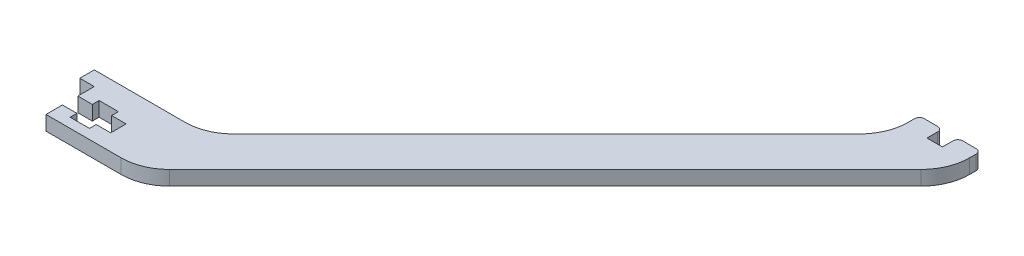
ISO-10303-21;
HEADER;
FILE_DESCRIPTION(('STEP AP214'),'2;1');
FILE_NAME('part.step','',(''),(''),'','','');
FILE_SCHEMA(('AUTOMOTIVE_DESIGN { 1 0 10303 214 1 1 1 1 }'));
ENDSEC;
DATA;
#1=APPLICATION_CONTEXT('core data for automotive mechanical design processes');
#2=APPLICATION_PROTOCOL_DEFINITION('international standard','automotive_design',2000,#1);
#3=PRODUCT_CONTEXT('',#1,'mechanical');
#4=PRODUCT('Part','Part','',(#3));
#5=PRODUCT_RELATED_PRODUCT_CATEGORY('part','',(#4));
#6=PRODUCT_DEFINITION_FORMATION('','',#4);
#7=PRODUCT_DEFINITION_CONTEXT('part definition',#1,'design');
#8=PRODUCT_DEFINITION('design','',#6,#7);
#9=PRODUCT_DEFINITION_SHAPE('','',#8);
#10=(LENGTH_UNIT() NAMED_UNIT(*) SI_UNIT(.MILLI.,.METRE.));
#11=(NAMED_UNIT(*) PLANE_ANGLE_UNIT() SI_UNIT($,.RADIAN.));
#12=(NAMED_UNIT(*) SI_UNIT($,.STERADIAN.) SOLID_ANGLE_UNIT());
#13=UNCERTAINTY_MEASURE_WITH_UNIT(LENGTH_MEASURE(1.E-05),#10,'distance_accuracy_value','');
#14=(GEOMETRIC_REPRESENTATION_CONTEXT(3) GLOBAL_UNCERTAINTY_ASSIGNED_CONTEXT((#13)) GLOBAL_UNIT_ASSIGNED_CONTEXT((#10,
#11,#12)) REPRESENTATION_CONTEXT('',''));
#15=CARTESIAN_POINT('',(0.,0.,0.));
#16=DIRECTION('',(0.,0.,1.));
#17=DIRECTION('',(1.,0.,0.));
#18=AXIS2_PLACEMENT_3D('',#15,#16,#17);
#19=CARTESIAN_POINT('',(15.857864376269,3.,-23.));
#20=DIRECTION('',(0.,-1.,0.));
#21=DIRECTION('',(0.,0.,-1.));
#22=AXIS2_PLACEMENT_3D('',#19,#20,#21);
#23=CYLINDRICAL_SURFACE('',#22,10.);
#24=CARTESIAN_POINT('',(15.857864376269,0.,-23.));
#25=DIRECTION('',(0.,1.,0.));
#26=DIRECTION('',(0.,0.,1.));
#27=AXIS2_PLACEMENT_3D('',#24,#25,#26);
#28=CIRCLE('',#27,10.);
#29=CARTESIAN_POINT('',(15.857864376269,0.,-13.));
#30=VERTEX_POINT('',#29);
#31=CARTESIAN_POINT('',(22.9289321881346,0.,-15.9289321881346));
#32=VERTEX_POINT('',#31);
#33=EDGE_CURVE('E306',#30,#32,#28,.T.);
#34=ORIENTED_EDGE('',*,*,#33,.F.);
#35=DIRECTION('',(0.,-1.,0.));
#36=VECTOR('',#35,1.);
#37=CARTESIAN_POINT('',(15.857864376269,3.,-13.));
#38=LINE('',#37,#36);
#39=CARTESIAN_POINT('',(15.857864376269,3.,-13.));
#40=VERTEX_POINT('',#39);
#41=EDGE_CURVE('E301',#40,#30,#38,.T.);
#42=ORIENTED_EDGE('',*,*,#41,.F.);
#43=CARTESIAN_POINT('',(15.857864376269,3.,-23.));
#44=DIRECTION('',(0.,1.,0.));
#45=DIRECTION('',(0.,0.,1.));
#46=AXIS2_PLACEMENT_3D('',#43,#44,#45);
#47=CIRCLE('',#46,10.);
#48=CARTESIAN_POINT('',(22.9289321881346,3.,-15.9289321881346));
#49=VERTEX_POINT('',#48);
#50=EDGE_CURVE('E303',#40,#49,#47,.T.);
#51=ORIENTED_EDGE('',*,*,#50,.T.);
#52=DIRECTION('',(0.,-1.,0.));
#53=VECTOR('',#52,1.);
#54=CARTESIAN_POINT('',(22.9289321881346,3.,-15.9289321881346));
#55=LINE('',#54,#53);
#56=EDGE_CURVE('E416',#49,#32,#55,.T.);
#57=ORIENTED_EDGE('',*,*,#56,.T.);
#58=EDGE_LOOP('',(#34,#42,#51,#57));
#59=FACE_BOUND('',#58,.T.);
#60=ADVANCED_FACE('F39',(#59),#23,.F.);
#61=CARTESIAN_POINT('',(0.,3.,-13.));
#62=DIRECTION('',(0.,0.,-1.));
#63=DIRECTION('',(-1.,0.,0.));
#64=AXIS2_PLACEMENT_3D('',#61,#62,#63);
#65=PLANE('',#64);
#66=DIRECTION('',(1.,0.,0.));
#67=VECTOR('',#66,1.);
#68=CARTESIAN_POINT('',(0.,0.,-13.));
#69=LINE('',#68,#67);
#70=CARTESIAN_POINT('',(-3.,0.,-13.));
#71=VERTEX_POINT('',#70);
#72=EDGE_CURVE('E419',#71,#30,#69,.T.);
#73=ORIENTED_EDGE('',*,*,#72,.F.);
#74=DIRECTION('',(0.,-1.,0.));
#75=VECTOR('',#74,1.);
#76=CARTESIAN_POINT('',(-3.,3.,-13.));
#77=LINE('',#76,#75);
#78=CARTESIAN_POINT('',(-3.,3.,-13.));
#79=VERTEX_POINT('',#78);
#80=EDGE_CURVE('E313',#79,#71,#77,.T.);
#81=ORIENTED_EDGE('',*,*,#80,.F.);
#82=DIRECTION('',(1.,0.,0.));
#83=VECTOR('',#82,1.);
#84=CARTESIAN_POINT('',(0.,3.,-13.));
#85=LINE('',#84,#83);
#86=EDGE_CURVE('E318',#79,#40,#85,.T.);
#87=ORIENTED_EDGE('',*,*,#86,.T.);
#88=ORIENTED_EDGE('',*,*,#41,.T.);
#89=EDGE_LOOP('',(#73,#81,#87,#88));
#90=FACE_BOUND('',#89,.T.);
#91=ADVANCED_FACE('F325',(#90),#65,.T.);
#92=CARTESIAN_POINT('',(-3.,3.,0.));
#93=DIRECTION('',(1.,0.,0.));
#94=DIRECTION('',(0.,0.,-1.));
#95=AXIS2_PLACEMENT_3D('',#92,#93,#94);
#96=PLANE('',#95);
#97=DIRECTION('',(0.,0.,1.));
#98=VECTOR('',#97,1.);
#99=CARTESIAN_POINT('',(-3.,0.,0.));
#100=LINE('',#99,#98);
#101=CARTESIAN_POINT('',(-3.,0.,-10.));
#102=VERTEX_POINT('',#101);
#103=EDGE_CURVE('E422',#71,#102,#100,.T.);
#104=ORIENTED_EDGE('',*,*,#103,.T.);
#105=DIRECTION('',(0.,-1.,0.));
#106=VECTOR('',#105,1.);
#107=CARTESIAN_POINT('',(-3.,3.,-10.));
#108=LINE('',#107,#106);
#109=CARTESIAN_POINT('',(-3.,3.,-10.));
#110=VERTEX_POINT('',#109);
#111=EDGE_CURVE('E583',#110,#102,#108,.T.);
#112=ORIENTED_EDGE('',*,*,#111,.F.);
#113=DIRECTION('',(0.,0.,1.));
#114=VECTOR('',#113,1.);
#115=CARTESIAN_POINT('',(-3.,3.,0.));
#116=LINE('',#115,#114);
#117=EDGE_CURVE('E328',#79,#110,#116,.T.);
#118=ORIENTED_EDGE('',*,*,#117,.F.);
#119=ORIENTED_EDGE('',*,*,#80,.T.);
#120=EDGE_LOOP('',(#104,#112,#118,#119));
#121=FACE_BOUND('',#120,.T.);
#122=ADVANCED_FACE('F670',(#121),#96,.F.);
#123=CARTESIAN_POINT('',(0.,3.,-10.));
#124=DIRECTION('',(0.,0.,1.));
#125=DIRECTION('',(1.,0.,0.));
#126=AXIS2_PLACEMENT_3D('',#123,#124,#125);
#127=PLANE('',#126);
#128=DIRECTION('',(-1.,0.,0.));
#129=VECTOR('',#128,1.);
#130=CARTESIAN_POINT('',(0.,0.,-10.));
#131=LINE('',#130,#129);
#132=CARTESIAN_POINT('',(0.,0.,-10.));
#133=VERTEX_POINT('',#132);
#134=EDGE_CURVE('E426',#133,#102,#131,.T.);
#135=ORIENTED_EDGE('',*,*,#134,.F.);
#136=DIRECTION('',(0.,-1.,0.));
#137=VECTOR('',#136,1.);
#138=CARTESIAN_POINT('',(0.,3.,-10.));
#139=LINE('',#138,#137);
#140=CARTESIAN_POINT('',(0.,3.,-10.));
#141=VERTEX_POINT('',#140);
#142=EDGE_CURVE('E580',#141,#133,#139,.T.);
#143=ORIENTED_EDGE('',*,*,#142,.F.);
#144=DIRECTION('',(-1.,0.,0.));
#145=VECTOR('',#144,1.);
#146=CARTESIAN_POINT('',(0.,3.,-10.));
#147=LINE('',#146,#145);
#148=EDGE_CURVE('E332',#141,#110,#147,.T.);
#149=ORIENTED_EDGE('',*,*,#148,.T.);
#150=ORIENTED_EDGE('',*,*,#111,.T.);
#151=EDGE_LOOP('',(#135,#143,#149,#150));
#152=FACE_BOUND('',#151,.T.);
#153=ADVANCED_FACE('F1010',(#152),#127,.T.);
#154=CARTESIAN_POINT('',(0.,3.,0.));
#155=DIRECTION('',(-1.,0.,0.));
#156=DIRECTION('',(0.,0.,1.));
#157=AXIS2_PLACEMENT_3D('',#154,#155,#156);
#158=PLANE('',#157);
#159=DIRECTION('',(0.,0.,-1.));
#160=VECTOR('',#159,1.);
#161=CARTESIAN_POINT('',(0.,0.,0.));
#162=LINE('',#161,#160);
#163=CARTESIAN_POINT('',(0.,0.,-6.6));
#164=VERTEX_POINT('',#163);
#165=EDGE_CURVE('E430',#164,#133,#162,.T.);
#166=ORIENTED_EDGE('',*,*,#165,.F.);
#167=DIRECTION('',(0.,-1.,0.));
#168=VECTOR('',#167,1.);
#169=CARTESIAN_POINT('',(0.,3.,-6.6));
#170=LINE('',#169,#168);
#171=CARTESIAN_POINT('',(0.,3.,-6.6));
#172=VERTEX_POINT('',#171);
#173=EDGE_CURVE('E577',#172,#164,#170,.T.);
#174=ORIENTED_EDGE('',*,*,#173,.F.);
#175=DIRECTION('',(0.,0.,-1.));
#176=VECTOR('',#175,1.);
#177=CARTESIAN_POINT('',(0.,3.,0.));
#178=LINE('',#177,#176);
#179=EDGE_CURVE('E338',#172,#141,#178,.T.);
#180=ORIENTED_EDGE('',*,*,#179,.T.);
#181=ORIENTED_EDGE('',*,*,#142,.T.);
#182=EDGE_LOOP('',(#166,#174,#180,#181));
#183=FACE_BOUND('',#182,.T.);
#184=ADVANCED_FACE('F676',(#183),#158,.T.);
#185=CARTESIAN_POINT('',(0.,3.,-6.6));
#186=DIRECTION('',(0.,0.,-1.));
#187=DIRECTION('',(-1.,0.,0.));
#188=AXIS2_PLACEMENT_3D('',#185,#186,#187);
#189=PLANE('',#188);
#190=DIRECTION('',(1.,0.,0.));
#191=VECTOR('',#190,1.);
#192=CARTESIAN_POINT('',(0.,0.,-6.6));
#193=LINE('',#192,#191);
#194=CARTESIAN_POINT('',(3.,0.,-6.6));
#195=VERTEX_POINT('',#194);
#196=EDGE_CURVE('E434',#164,#195,#193,.T.);
#197=ORIENTED_EDGE('',*,*,#196,.T.);
#198=DIRECTION('',(0.,-1.,0.));
#199=VECTOR('',#198,1.);
#200=CARTESIAN_POINT('',(3.,3.,-6.6));
#201=LINE('',#200,#199);
#202=CARTESIAN_POINT('',(3.,3.,-6.6));
#203=VERTEX_POINT('',#202);
#204=EDGE_CURVE('E574',#203,#195,#201,.T.);
#205=ORIENTED_EDGE('',*,*,#204,.F.);
#206=DIRECTION('',(1.,0.,0.));
#207=VECTOR('',#206,1.);
#208=CARTESIAN_POINT('',(0.,3.,-6.6));
#209=LINE('',#208,#207);
#210=EDGE_CURVE('E342',#172,#203,#209,.T.);
#211=ORIENTED_EDGE('',*,*,#210,.F.);
#212=ORIENTED_EDGE('',*,*,#173,.T.);
#213=EDGE_LOOP('',(#197,#205,#211,#212));
#214=FACE_BOUND('',#213,.T.);
#215=ADVANCED_FACE('F681',(#214),#189,.F.);
#216=CARTESIAN_POINT('',(3.,3.,0.));
#217=DIRECTION('',(1.,0.,0.));
#218=DIRECTION('',(0.,0.,-1.));
#219=AXIS2_PLACEMENT_3D('',#216,#217,#218);
#220=PLANE('',#219);
#221=DIRECTION('',(0.,0.,1.));
#222=VECTOR('',#221,1.);
#223=CARTESIAN_POINT('',(3.,0.,0.));
#224=LINE('',#223,#222);
#225=CARTESIAN_POINT('',(3.,0.,-8.));
#226=VERTEX_POINT('',#225);
#227=EDGE_CURVE('E439',#226,#195,#224,.T.);
#228=ORIENTED_EDGE('',*,*,#227,.F.);
#229=DIRECTION('',(0.,-1.,0.));
#230=VECTOR('',#229,1.);
#231=CARTESIAN_POINT('',(3.,3.,-8.));
#232=LINE('',#231,#230);
#233=CARTESIAN_POINT('',(3.,3.,-8.));
#234=VERTEX_POINT('',#233);
#235=EDGE_CURVE('E571',#234,#226,#232,.T.);
#236=ORIENTED_EDGE('',*,*,#235,.F.);
#237=DIRECTION('',(0.,0.,1.));
#238=VECTOR('',#237,1.);
#239=CARTESIAN_POINT('',(3.,3.,0.));
#240=LINE('',#239,#238);
#241=EDGE_CURVE('E346',#234,#203,#240,.T.);
#242=ORIENTED_EDGE('',*,*,#241,.T.);
#243=ORIENTED_EDGE('',*,*,#204,.T.);
#244=EDGE_LOOP('',(#228,#236,#242,#243));
#245=FACE_BOUND('',#244,.T.);
#246=ADVANCED_FACE('F687',(#245),#220,.T.);
#247=CARTESIAN_POINT('',(0.,3.,-8.));
#248=DIRECTION('',(0.,0.,-1.));
#249=DIRECTION('',(-1.,0.,0.));
#250=AXIS2_PLACEMENT_3D('',#247,#248,#249);
#251=PLANE('',#250);
#252=DIRECTION('',(1.,0.,0.));
#253=VECTOR('',#252,1.);
#254=CARTESIAN_POINT('',(0.,0.,-8.));
#255=LINE('',#254,#253);
#256=CARTESIAN_POINT('',(7.,0.,-8.));
#257=VERTEX_POINT('',#256);
#258=EDGE_CURVE('E443',#226,#257,#255,.T.);
#259=ORIENTED_EDGE('',*,*,#258,.T.);
#260=DIRECTION('',(0.,-1.,0.));
#261=VECTOR('',#260,1.);
#262=CARTESIAN_POINT('',(7.,3.,-8.));
#263=LINE('',#262,#261);
#264=CARTESIAN_POINT('',(7.,3.,-8.));
#265=VERTEX_POINT('',#264);
#266=EDGE_CURVE('E567',#265,#257,#263,.T.);
#267=ORIENTED_EDGE('',*,*,#266,.F.);
#268=DIRECTION('',(1.,0.,0.));
#269=VECTOR('',#268,1.);
#270=CARTESIAN_POINT('',(0.,3.,-8.));
#271=LINE('',#270,#269);
#272=EDGE_CURVE('E350',#234,#265,#271,.T.);
#273=ORIENTED_EDGE('',*,*,#272,.F.);
#274=ORIENTED_EDGE('',*,*,#235,.T.);
#275=EDGE_LOOP('',(#259,#267,#273,#274));
#276=FACE_BOUND('',#275,.T.);
#277=ADVANCED_FACE('F690',(#276),#251,.F.);
#278=CARTESIAN_POINT('',(6.99999999999999,3.,0.));
#279=DIRECTION('',(1.,0.,0.));
#280=DIRECTION('',(0.,0.,-1.));
#281=AXIS2_PLACEMENT_3D('',#278,#279,#280);
#282=PLANE('',#281);
#283=DIRECTION('',(0.,0.,1.));
#284=VECTOR('',#283,1.);
#285=CARTESIAN_POINT('',(6.99999999999999,0.,0.));
#286=LINE('',#285,#284);
#287=CARTESIAN_POINT('',(7.,0.,-6.6));
#288=VERTEX_POINT('',#287);
#289=EDGE_CURVE('E446',#257,#288,#286,.T.);
#290=ORIENTED_EDGE('',*,*,#289,.T.);
#291=DIRECTION('',(0.,-1.,0.));
#292=VECTOR('',#291,1.);
#293=CARTESIAN_POINT('',(7.,3.,-6.6));
#294=LINE('',#293,#292);
#295=CARTESIAN_POINT('',(7.,3.,-6.6));
#296=VERTEX_POINT('',#295);
#297=EDGE_CURVE('E563',#296,#288,#294,.T.);
#298=ORIENTED_EDGE('',*,*,#297,.F.);
#299=DIRECTION('',(0.,0.,1.));
#300=VECTOR('',#299,1.);
#301=CARTESIAN_POINT('',(6.99999999999999,3.,0.));
#302=LINE('',#301,#300);
#303=EDGE_CURVE('E353',#265,#296,#302,.T.);
#304=ORIENTED_EDGE('',*,*,#303,.F.);
#305=ORIENTED_EDGE('',*,*,#266,.T.);
#306=EDGE_LOOP('',(#290,#298,#304,#305));
#307=FACE_BOUND('',#306,.T.);
#308=ADVANCED_FACE('F695',(#307),#282,.F.);
#309=CARTESIAN_POINT('',(0.,3.,-6.6));
#310=DIRECTION('',(0.,0.,-1.));
#311=DIRECTION('',(-1.,0.,0.));
#312=AXIS2_PLACEMENT_3D('',#309,#310,#311);
#313=PLANE('',#312);
#314=DIRECTION('',(1.,0.,0.));
#315=VECTOR('',#314,1.);
#316=CARTESIAN_POINT('',(0.,0.,-6.6));
#317=LINE('',#316,#315);
#318=CARTESIAN_POINT('',(10.,0.,-6.6));
#319=VERTEX_POINT('',#318);
#320=EDGE_CURVE('E449',#288,#319,#317,.T.);
#321=ORIENTED_EDGE('',*,*,#320,.T.);
#322=DIRECTION('',(0.,-1.,0.));
#323=VECTOR('',#322,1.);
#324=CARTESIAN_POINT('',(10.,3.,-6.6));
#325=LINE('',#324,#323);
#326=CARTESIAN_POINT('',(10.,3.,-6.6));
#327=VERTEX_POINT('',#326);
#328=EDGE_CURVE('E559',#327,#319,#325,.T.);
#329=ORIENTED_EDGE('',*,*,#328,.F.);
#330=DIRECTION('',(1.,0.,0.));
#331=VECTOR('',#330,1.);
#332=CARTESIAN_POINT('',(0.,3.,-6.6));
#333=LINE('',#332,#331);
#334=EDGE_CURVE('E356',#296,#327,#333,.T.);
#335=ORIENTED_EDGE('',*,*,#334,.F.);
#336=ORIENTED_EDGE('',*,*,#297,.T.);
#337=EDGE_LOOP('',(#321,#329,#335,#336));
#338=FACE_BOUND('',#337,.T.);
#339=ADVANCED_FACE('F702',(#338),#313,.F.);
#340=CARTESIAN_POINT('',(10.,3.,0.));
#341=DIRECTION('',(1.,0.,0.));
#342=DIRECTION('',(0.,0.,-1.));
#343=AXIS2_PLACEMENT_3D('',#340,#341,#342);
#344=PLANE('',#343);
#345=DIRECTION('',(0.,0.,1.));
#346=VECTOR('',#345,1.);
#347=CARTESIAN_POINT('',(10.,0.,0.));
#348=LINE('',#347,#346);
#349=CARTESIAN_POINT('',(10.,0.,-3.4));
#350=VERTEX_POINT('',#349);
#351=EDGE_CURVE('E452',#319,#350,#348,.T.);
#352=ORIENTED_EDGE('',*,*,#351,.T.);
#353=DIRECTION('',(0.,-1.,0.));
#354=VECTOR('',#353,1.);
#355=CARTESIAN_POINT('',(10.,3.,-3.4));
#356=LINE('',#355,#354);
#357=CARTESIAN_POINT('',(10.,3.,-3.4));
#358=VERTEX_POINT('',#357);
#359=EDGE_CURVE('E556',#358,#350,#356,.T.);
#360=ORIENTED_EDGE('',*,*,#359,.F.);
#361=DIRECTION('',(0.,0.,1.));
#362=VECTOR('',#361,1.);
#363=CARTESIAN_POINT('',(10.,3.,0.));
#364=LINE('',#363,#362);
#365=EDGE_CURVE('E359',#327,#358,#364,.T.);
#366=ORIENTED_EDGE('',*,*,#365,.F.);
#367=ORIENTED_EDGE('',*,*,#328,.T.);
#368=EDGE_LOOP('',(#352,#360,#366,#367));
#369=FACE_BOUND('',#368,.T.);
#370=ADVANCED_FACE('F706',(#369),#344,.F.);
#371=CARTESIAN_POINT('',(0.,3.,-3.4));
#372=DIRECTION('',(0.,0.,-1.));
#373=DIRECTION('',(-1.,0.,0.));
#374=AXIS2_PLACEMENT_3D('',#371,#372,#373);
#375=PLANE('',#374);
#376=DIRECTION('',(1.,0.,0.));
#377=VECTOR('',#376,1.);
#378=CARTESIAN_POINT('',(0.,0.,-3.4));
#379=LINE('',#378,#377);
#380=CARTESIAN_POINT('',(7.,0.,-3.4));
#381=VERTEX_POINT('',#380);
#382=EDGE_CURVE('E456',#381,#350,#379,.T.);
#383=ORIENTED_EDGE('',*,*,#382,.F.);
#384=DIRECTION('',(0.,-1.,0.));
#385=VECTOR('',#384,1.);
#386=CARTESIAN_POINT('',(7.,3.,-3.4));
#387=LINE('',#386,#385);
#388=CARTESIAN_POINT('',(7.,3.,-3.4));
#389=VERTEX_POINT('',#388);
#390=EDGE_CURVE('E553',#389,#381,#387,.T.);
#391=ORIENTED_EDGE('',*,*,#390,.F.);
#392=DIRECTION('',(1.,0.,0.));
#393=VECTOR('',#392,1.);
#394=CARTESIAN_POINT('',(0.,3.,-3.4));
#395=LINE('',#394,#393);
#396=EDGE_CURVE('E362',#389,#358,#395,.T.);
#397=ORIENTED_EDGE('',*,*,#396,.T.);
#398=ORIENTED_EDGE('',*,*,#359,.T.);
#399=EDGE_LOOP('',(#383,#391,#397,#398));
#400=FACE_BOUND('',#399,.T.);
#401=ADVANCED_FACE('F709',(#400),#375,.T.);
#402=CARTESIAN_POINT('',(7.,3.,0.));
#403=DIRECTION('',(1.,0.,0.));
#404=DIRECTION('',(0.,0.,-1.));
#405=AXIS2_PLACEMENT_3D('',#402,#403,#404);
#406=PLANE('',#405);
#407=DIRECTION('',(0.,0.,1.));
#408=VECTOR('',#407,1.);
#409=CARTESIAN_POINT('',(7.,0.,0.));
#410=LINE('',#409,#408);
#411=CARTESIAN_POINT('',(7.,0.,-2.));
#412=VERTEX_POINT('',#411);
#413=EDGE_CURVE('E460',#381,#412,#410,.T.);
#414=ORIENTED_EDGE('',*,*,#413,.T.);
#415=DIRECTION('',(0.,-1.,0.));
#416=VECTOR('',#415,1.);
#417=CARTESIAN_POINT('',(7.,3.,-2.));
#418=LINE('',#417,#416);
#419=CARTESIAN_POINT('',(7.,3.,-2.));
#420=VERTEX_POINT('',#419);
#421=EDGE_CURVE('E550',#420,#412,#418,.T.);
#422=ORIENTED_EDGE('',*,*,#421,.F.);
#423=DIRECTION('',(0.,0.,1.));
#424=VECTOR('',#423,1.);
#425=CARTESIAN_POINT('',(7.,3.,0.));
#426=LINE('',#425,#424);
#427=EDGE_CURVE('E366',#389,#420,#426,.T.);
#428=ORIENTED_EDGE('',*,*,#427,.F.);
#429=ORIENTED_EDGE('',*,*,#390,.T.);
#430=EDGE_LOOP('',(#414,#422,#428,#429));
#431=FACE_BOUND('',#430,.T.);
#432=ADVANCED_FACE('F715',(#431),#406,.F.);
#433=CARTESIAN_POINT('',(0.,3.,-2.));
#434=DIRECTION('',(0.,0.,-1.));
#435=DIRECTION('',(-1.,0.,0.));
#436=AXIS2_PLACEMENT_3D('',#433,#434,#435);
#437=PLANE('',#436);
#438=DIRECTION('',(1.,0.,0.));
#439=VECTOR('',#438,1.);
#440=CARTESIAN_POINT('',(0.,0.,-2.));
#441=LINE('',#440,#439);
#442=CARTESIAN_POINT('',(3.,0.,-2.));
#443=VERTEX_POINT('',#442);
#444=EDGE_CURVE('E464',#443,#412,#441,.T.);
#445=ORIENTED_EDGE('',*,*,#444,.F.);
#446=DIRECTION('',(0.,-1.,0.));
#447=VECTOR('',#446,1.);
#448=CARTESIAN_POINT('',(3.,3.,-2.));
#449=LINE('',#448,#447);
#450=CARTESIAN_POINT('',(3.,3.,-2.));
#451=VERTEX_POINT('',#450);
#452=EDGE_CURVE('E547',#451,#443,#449,.T.);
#453=ORIENTED_EDGE('',*,*,#452,.F.);
#454=DIRECTION('',(1.,0.,0.));
#455=VECTOR('',#454,1.);
#456=CARTESIAN_POINT('',(0.,3.,-2.));
#457=LINE('',#456,#455);
#458=EDGE_CURVE('E369',#451,#420,#457,.T.);
#459=ORIENTED_EDGE('',*,*,#458,.T.);
#460=ORIENTED_EDGE('',*,*,#421,.T.);
#461=EDGE_LOOP('',(#445,#453,#459,#460));
#462=FACE_BOUND('',#461,.T.);
#463=ADVANCED_FACE('F719',(#462),#437,.T.);
#464=CARTESIAN_POINT('',(3.,3.,0.));
#465=DIRECTION('',(1.,0.,0.));
#466=DIRECTION('',(0.,0.,-1.));
#467=AXIS2_PLACEMENT_3D('',#464,#465,#466);
#468=PLANE('',#467);
#469=DIRECTION('',(0.,0.,1.));
#470=VECTOR('',#469,1.);
#471=CARTESIAN_POINT('',(3.,0.,0.));
#472=LINE('',#471,#470);
#473=CARTESIAN_POINT('',(3.,0.,-3.4));
#474=VERTEX_POINT('',#473);
#475=EDGE_CURVE('E468',#474,#443,#472,.T.);
#476=ORIENTED_EDGE('',*,*,#475,.F.);
#477=DIRECTION('',(0.,-1.,0.));
#478=VECTOR('',#477,1.);
#479=CARTESIAN_POINT('',(3.,3.,-3.4));
#480=LINE('',#479,#478);
#481=CARTESIAN_POINT('',(3.,3.,-3.4));
#482=VERTEX_POINT('',#481);
#483=EDGE_CURVE('E544',#482,#474,#480,.T.);
#484=ORIENTED_EDGE('',*,*,#483,.F.);
#485=DIRECTION('',(0.,0.,1.));
#486=VECTOR('',#485,1.);
#487=CARTESIAN_POINT('',(3.,3.,0.));
#488=LINE('',#487,#486);
#489=EDGE_CURVE('E373',#482,#451,#488,.T.);
#490=ORIENTED_EDGE('',*,*,#489,.T.);
#491=ORIENTED_EDGE('',*,*,#452,.T.);
#492=EDGE_LOOP('',(#476,#484,#490,#491));
#493=FACE_BOUND('',#492,.T.);
#494=ADVANCED_FACE('F722',(#493),#468,.T.);
#495=CARTESIAN_POINT('',(0.,3.,-3.4));
#496=DIRECTION('',(0.,0.,-1.));
#497=DIRECTION('',(-1.,0.,0.));
#498=AXIS2_PLACEMENT_3D('',#495,#496,#497);
#499=PLANE('',#498);
#500=DIRECTION('',(1.,0.,0.));
#501=VECTOR('',#500,1.);
#502=CARTESIAN_POINT('',(0.,0.,-3.4));
#503=LINE('',#502,#501);
#504=CARTESIAN_POINT('',(0.,0.,-3.4));
#505=VERTEX_POINT('',#504);
#506=EDGE_CURVE('E472',#505,#474,#503,.T.);
#507=ORIENTED_EDGE('',*,*,#506,.F.);
#508=DIRECTION('',(0.,-1.,0.));
#509=VECTOR('',#508,1.);
#510=CARTESIAN_POINT('',(0.,3.,-3.4));
#511=LINE('',#510,#509);
#512=CARTESIAN_POINT('',(0.,3.,-3.4));
#513=VERTEX_POINT('',#512);
#514=EDGE_CURVE('E541',#513,#505,#511,.T.);
#515=ORIENTED_EDGE('',*,*,#514,.F.);
#516=DIRECTION('',(1.,0.,0.));
#517=VECTOR('',#516,1.);
#518=CARTESIAN_POINT('',(0.,3.,-3.4));
#519=LINE('',#518,#517);
#520=EDGE_CURVE('E377',#513,#482,#519,.T.);
#521=ORIENTED_EDGE('',*,*,#520,.T.);
#522=ORIENTED_EDGE('',*,*,#483,.T.);
#523=EDGE_LOOP('',(#507,#515,#521,#522));
#524=FACE_BOUND('',#523,.T.);
#525=ADVANCED_FACE('F728',(#524),#499,.T.);
#526=CARTESIAN_POINT('',(0.,0.,0.));
#527=VERTEX_POINT('',#526);
#528=EDGE_CURVE('E435',#527,#505,#162,.T.);
#529=ORIENTED_EDGE('',*,*,#528,.F.);
#530=DIRECTION('',(0.,-1.,0.));
#531=VECTOR('',#530,1.);
#532=CARTESIAN_POINT('',(0.,3.,0.));
#533=LINE('',#532,#531);
#534=CARTESIAN_POINT('',(0.,3.,0.));
#535=VERTEX_POINT('',#534);
#536=EDGE_CURVE('E538',#535,#527,#533,.T.);
#537=ORIENTED_EDGE('',*,*,#536,.F.);
#538=EDGE_CURVE('E343',#535,#513,#178,.T.);
#539=ORIENTED_EDGE('',*,*,#538,.T.);
#540=ORIENTED_EDGE('',*,*,#514,.T.);
#541=EDGE_LOOP('',(#529,#537,#539,#540));
#542=FACE_BOUND('',#541,.T.);
#543=ADVANCED_FACE('F732',(#542),#158,.T.);
#544=CARTESIAN_POINT('',(0.,3.,0.));
#545=DIRECTION('',(0.,0.,-1.));
#546=DIRECTION('',(-1.,0.,0.));
#547=AXIS2_PLACEMENT_3D('',#544,#545,#546);
#548=PLANE('',#547);
#549=DIRECTION('',(1.,0.,0.));
#550=VECTOR('',#549,1.);
#551=CARTESIAN_POINT('',(0.,0.,0.));
#552=LINE('',#551,#550);
#553=CARTESIAN_POINT('',(15.5857864376269,0.,0.));
#554=VERTEX_POINT('',#553);
#555=EDGE_CURVE('E476',#527,#554,#552,.T.);
#556=ORIENTED_EDGE('',*,*,#555,.T.);
#557=DIRECTION('',(0.,-1.,0.));
#558=VECTOR('',#557,1.);
#559=CARTESIAN_POINT('',(15.5857864376269,3.,0.));
#560=LINE('',#559,#558);
#561=CARTESIAN_POINT('',(15.5857864376269,3.,0.));
#562=VERTEX_POINT('',#561);
#563=EDGE_CURVE('E535',#562,#554,#560,.T.);
#564=ORIENTED_EDGE('',*,*,#563,.F.);
#565=DIRECTION('',(1.,0.,0.));
#566=VECTOR('',#565,1.);
#567=CARTESIAN_POINT('',(0.,3.,0.));
#568=LINE('',#567,#566);
#569=EDGE_CURVE('E381',#535,#562,#568,.T.);
#570=ORIENTED_EDGE('',*,*,#569,.F.);
#571=ORIENTED_EDGE('',*,*,#536,.T.);
#572=EDGE_LOOP('',(#556,#564,#570,#571));
#573=FACE_BOUND('',#572,.T.);
#574=ADVANCED_FACE('F741',(#573),#548,.F.);
#575=CARTESIAN_POINT('',(15.5857864376269,3.,-9.99999999999999));
#576=DIRECTION('',(0.,-1.,0.));
#577=DIRECTION('',(0.,0.,-1.));
#578=AXIS2_PLACEMENT_3D('',#575,#576,#577);
#579=CYLINDRICAL_SURFACE('',#578,10.);
#580=CARTESIAN_POINT('',(15.5857864376269,0.,-9.99999999999999));
#581=DIRECTION('',(0.,1.,0.));
#582=DIRECTION('',(0.,0.,1.));
#583=AXIS2_PLACEMENT_3D('',#580,#581,#582);
#584=CIRCLE('',#583,10.);
#585=CARTESIAN_POINT('',(22.6568542494924,0.,-2.92893218813456));
#586=VERTEX_POINT('',#585);
#587=EDGE_CURVE('E480',#586,#554,#584,.F.);
#588=ORIENTED_EDGE('',*,*,#587,.F.);
#589=DIRECTION('',(0.,-1.,0.));
#590=VECTOR('',#589,1.);
#591=CARTESIAN_POINT('',(22.6568542494924,3.,-2.92893218813456));
#592=LINE('',#591,#590);
#593=CARTESIAN_POINT('',(22.6568542494924,3.,-2.92893218813456));
#594=VERTEX_POINT('',#593);
#595=EDGE_CURVE('E532',#594,#586,#592,.T.);
#596=ORIENTED_EDGE('',*,*,#595,.F.);
#597=CARTESIAN_POINT('',(15.5857864376269,3.,-9.99999999999999));
#598=DIRECTION('',(0.,1.,0.));
#599=DIRECTION('',(0.,0.,1.));
#600=AXIS2_PLACEMENT_3D('',#597,#598,#599);
#601=CIRCLE('',#600,10.);
#602=EDGE_CURVE('E384',#594,#562,#601,.F.);
#603=ORIENTED_EDGE('',*,*,#602,.T.);
#604=ORIENTED_EDGE('',*,*,#563,.T.);
#605=EDGE_LOOP('',(#588,#596,#603,#604));
#606=FACE_BOUND('',#605,.T.);
#607=ADVANCED_FACE('F746',(#606),#579,.T.);
#608=CARTESIAN_POINT('',(9.86396103067895,3.,9.86396103067893));
#609=DIRECTION('',(-0.707106781186548,0.,-0.707106781186547));
#610=DIRECTION('',(-0.707106781186547,0.,0.707106781186548));
#611=AXIS2_PLACEMENT_3D('',#608,#609,#610);
#612=PLANE('',#611);
#613=DIRECTION('',(0.707106781186547,0.,-0.707106781186548));
#614=VECTOR('',#613,1.);
#615=CARTESIAN_POINT('',(9.86396103067895,0.,9.86396103067893));
#616=LINE('',#615,#614);
#617=CARTESIAN_POINT('',(100.509667991878,0.,-80.7817459305203));
#618=VERTEX_POINT('',#617);
#619=EDGE_CURVE('E484',#586,#618,#616,.T.);
#620=ORIENTED_EDGE('',*,*,#619,.T.);
#621=DIRECTION('',(0.,-1.,0.));
#622=VECTOR('',#621,1.);
#623=CARTESIAN_POINT('',(100.509667991878,3.,-80.7817459305203));
#624=LINE('',#623,#622);
#625=CARTESIAN_POINT('',(100.509667991878,3.,-80.7817459305203));
#626=VERTEX_POINT('',#625);
#627=EDGE_CURVE('E530',#626,#618,#624,.T.);
#628=ORIENTED_EDGE('',*,*,#627,.F.);
#629=DIRECTION('',(0.707106781186547,0.,-0.707106781186548));
#630=VECTOR('',#629,1.);
#631=CARTESIAN_POINT('',(9.86396103067895,3.,9.86396103067893));
#632=LINE('',#631,#630);
#633=EDGE_CURVE('E388',#594,#626,#632,.T.);
#634=ORIENTED_EDGE('',*,*,#633,.F.);
#635=ORIENTED_EDGE('',*,*,#595,.T.);
#636=EDGE_LOOP('',(#620,#628,#634,#635));
#637=FACE_BOUND('',#636,.T.);
#638=ADVANCED_FACE('F748',(#637),#612,.F.);
#639=CARTESIAN_POINT('',(93.4386001800125,3.,-87.8528137423858));
#640=DIRECTION('',(0.,-1.,0.));
#641=DIRECTION('',(0.,0.,-1.));
#642=AXIS2_PLACEMENT_3D('',#639,#640,#641);
#643=CYLINDRICAL_SURFACE('',#642,9.99999999999999);
#644=CARTESIAN_POINT('',(93.4386001800125,0.,-87.8528137423858));
#645=DIRECTION('',(0.,1.,0.));
#646=DIRECTION('',(0.,0.,1.));
#647=AXIS2_PLACEMENT_3D('',#644,#645,#646);
#648=CIRCLE('',#647,9.99999999999999);
#649=CARTESIAN_POINT('',(103.438600180013,0.,-87.8528137423858));
#650=VERTEX_POINT('',#649);
#651=EDGE_CURVE('E488',#650,#618,#648,.F.);
#652=ORIENTED_EDGE('',*,*,#651,.F.);
#653=DIRECTION('',(0.,-1.,0.));
#654=VECTOR('',#653,1.);
#655=CARTESIAN_POINT('',(103.438600180013,3.,-87.8528137423858));
#656=LINE('',#655,#654);
#657=CARTESIAN_POINT('',(103.438600180013,3.,-87.8528137423858));
#658=VERTEX_POINT('',#657);
#659=EDGE_CURVE('E527',#658,#650,#656,.T.);
#660=ORIENTED_EDGE('',*,*,#659,.F.);
#661=CARTESIAN_POINT('',(93.4386001800125,3.,-87.8528137423858));
#662=DIRECTION('',(0.,1.,0.));
#663=DIRECTION('',(0.,0.,1.));
#664=AXIS2_PLACEMENT_3D('',#661,#662,#663);
#665=CIRCLE('',#664,9.99999999999999);
#666=EDGE_CURVE('E391',#658,#626,#665,.F.);
#667=ORIENTED_EDGE('',*,*,#666,.T.);
#668=ORIENTED_EDGE('',*,*,#627,.T.);
#669=EDGE_LOOP('',(#652,#660,#667,#668));
#670=FACE_BOUND('',#669,.T.);
#671=ADVANCED_FACE('F751',(#670),#643,.T.);
#672=CARTESIAN_POINT('',(103.438600180013,3.,0.));
#673=DIRECTION('',(1.,0.,0.));
#674=DIRECTION('',(0.,0.,-1.));
#675=AXIS2_PLACEMENT_3D('',#672,#673,#674);
#676=PLANE('',#675);
#677=DIRECTION('',(0.,0.,1.));
#678=VECTOR('',#677,1.);
#679=CARTESIAN_POINT('',(103.438600180013,0.,0.));
#680=LINE('',#679,#678);
#681=CARTESIAN_POINT('',(103.438600180013,0.,-89.2106781186548));
#682=VERTEX_POINT('',#681);
#683=EDGE_CURVE('E491',#682,#650,#680,.T.);
#684=ORIENTED_EDGE('',*,*,#683,.F.);
#685=DIRECTION('',(0.,-1.,0.));
#686=VECTOR('',#685,1.);
#687=CARTESIAN_POINT('',(103.438600180013,3.,-89.2106781186548));
#688=LINE('',#687,#686);
#689=CARTESIAN_POINT('',(103.438600180013,3.,-89.2106781186548));
#690=VERTEX_POINT('',#689);
#691=EDGE_CURVE('E47',#682,#690,#688,.F.);
#692=ORIENTED_EDGE('',*,*,#691,.T.);
#693=DIRECTION('',(0.,0.,1.));
#694=VECTOR('',#693,1.);
#695=CARTESIAN_POINT('',(103.438600180013,3.,0.));
#696=LINE('',#695,#694);
#697=EDGE_CURVE('E394',#690,#658,#696,.T.);
#698=ORIENTED_EDGE('',*,*,#697,.T.);
#699=ORIENTED_EDGE('',*,*,#659,.T.);
#700=EDGE_LOOP('',(#684,#692,#698,#699));
#701=FACE_BOUND('',#700,.T.);
#702=ADVANCED_FACE('F618',(#701),#676,.T.);
#703=CARTESIAN_POINT('',(0.,3.,-90.2106781186548));
#704=DIRECTION('',(0.,0.,-1.));
#705=DIRECTION('',(-1.,0.,0.));
#706=AXIS2_PLACEMENT_3D('',#703,#704,#705);
#707=PLANE('',#706);
#708=DIRECTION('',(1.,0.,0.));
#709=VECTOR('',#708,1.);
#710=CARTESIAN_POINT('',(0.,0.,-90.2106781186548));
#711=LINE('',#710,#709);
#712=CARTESIAN_POINT('',(99.6736001800125,0.,-90.2106781186548));
#713=VERTEX_POINT('',#712);
#714=CARTESIAN_POINT('',(102.438600180013,0.,-90.2106781186548));
#715=VERTEX_POINT('',#714);
#716=EDGE_CURVE('E493',#713,#715,#711,.T.);
#717=ORIENTED_EDGE('',*,*,#716,.F.);
#718=DIRECTION('',(0.,-1.,0.));
#719=VECTOR('',#718,1.);
#720=CARTESIAN_POINT('',(99.6736001800125,3.,-90.2106781186548));
#721=LINE('',#720,#719);
#722=CARTESIAN_POINT('',(99.6736001800125,3.,-90.2106781186548));
#723=VERTEX_POINT('',#722);
#724=EDGE_CURVE('E613',#713,#723,#721,.F.);
#725=ORIENTED_EDGE('',*,*,#724,.T.);
#726=DIRECTION('',(1.,0.,0.));
#727=VECTOR('',#726,1.);
#728=CARTESIAN_POINT('',(0.,3.,-90.2106781186548));
#729=LINE('',#728,#727);
#730=CARTESIAN_POINT('',(102.438600180013,3.,-90.2106781186548));
#731=VERTEX_POINT('',#730);
#732=EDGE_CURVE('E396',#723,#731,#729,.T.);
#733=ORIENTED_EDGE('',*,*,#732,.T.);
#734=DIRECTION('',(0.,-1.,0.));
#735=VECTOR('',#734,1.);
#736=CARTESIAN_POINT('',(102.438600180013,3.,-90.2106781186548));
#737=LINE('',#736,#735);
#738=EDGE_CURVE('E610',#731,#715,#737,.T.);
#739=ORIENTED_EDGE('',*,*,#738,.T.);
#740=EDGE_LOOP('',(#717,#725,#733,#739));
#741=FACE_BOUND('',#740,.T.);
#742=ADVANCED_FACE('F627',(#741),#707,.T.);
#743=CARTESIAN_POINT('',(98.6736001800125,3.,0.));
#744=DIRECTION('',(1.,0.,0.));
#745=DIRECTION('',(0.,0.,-1.));
#746=AXIS2_PLACEMENT_3D('',#743,#744,#745);
#747=PLANE('',#746);
#748=DIRECTION('',(0.,0.,1.));
#749=VECTOR('',#748,1.);
#750=CARTESIAN_POINT('',(98.6736001800125,3.,0.));
#751=LINE('',#750,#749);
#752=CARTESIAN_POINT('',(98.6736001800125,3.,-89.2106781186548));
#753=VERTEX_POINT('',#752);
#754=CARTESIAN_POINT('',(98.6736001800125,3.,-87.0106781186548));
#755=VERTEX_POINT('',#754);
#756=EDGE_CURVE('E399',#753,#755,#751,.T.);
#757=ORIENTED_EDGE('',*,*,#756,.F.);
#758=DIRECTION('',(0.,-1.,0.));
#759=VECTOR('',#758,1.);
#760=CARTESIAN_POINT('',(98.6736001800125,0.,-89.2106781186548));
#761=LINE('',#760,#759);
#762=CARTESIAN_POINT('',(98.6736001800125,0.,-89.2106781186548));
#763=VERTEX_POINT('',#762);
#764=EDGE_CURVE('E607',#753,#763,#761,.T.);
#765=ORIENTED_EDGE('',*,*,#764,.T.);
#766=DIRECTION('',(0.,0.,1.));
#767=VECTOR('',#766,1.);
#768=CARTESIAN_POINT('',(98.6736001800125,0.,0.));
#769=LINE('',#768,#767);
#770=CARTESIAN_POINT('',(98.6736001800125,0.,-87.0106781186548));
#771=VERTEX_POINT('',#770);
#772=EDGE_CURVE('E496',#763,#771,#769,.T.);
#773=ORIENTED_EDGE('',*,*,#772,.T.);
#774=DIRECTION('',(0.,-1.,0.));
#775=VECTOR('',#774,1.);
#776=CARTESIAN_POINT('',(98.6736001800125,3.,-87.0106781186548));
#777=LINE('',#776,#775);
#778=EDGE_CURVE('E524',#755,#771,#777,.T.);
#779=ORIENTED_EDGE('',*,*,#778,.F.);
#780=EDGE_LOOP('',(#757,#765,#773,#779));
#781=FACE_BOUND('',#780,.T.);
#782=ADVANCED_FACE('F636',(#781),#747,.F.);
#783=CARTESIAN_POINT('',(-3.77348664982729E-13,3.,-87.0106781186544));
#784=DIRECTION('',(0.,0.,-1.));
#785=DIRECTION('',(-1.,0.,0.));
#786=AXIS2_PLACEMENT_3D('',#783,#784,#785);
#787=PLANE('',#786);
#788=DIRECTION('',(1.,0.,0.));
#789=VECTOR('',#788,1.);
#790=CARTESIAN_POINT('',(-3.77348664982729E-13,0.,-87.0106781186544));
#791=LINE('',#790,#789);
#792=CARTESIAN_POINT('',(95.4736001800125,0.,-87.0106781186548));
#793=VERTEX_POINT('',#792);
#794=EDGE_CURVE('E498',#793,#771,#791,.T.);
#795=ORIENTED_EDGE('',*,*,#794,.F.);
#796=DIRECTION('',(0.,-1.,0.));
#797=VECTOR('',#796,1.);
#798=CARTESIAN_POINT('',(95.4736001800125,3.,-87.0106781186548));
#799=LINE('',#798,#797);
#800=CARTESIAN_POINT('',(95.4736001800125,3.,-87.0106781186548));
#801=VERTEX_POINT('',#800);
#802=EDGE_CURVE('E521',#801,#793,#799,.T.);
#803=ORIENTED_EDGE('',*,*,#802,.F.);
#804=DIRECTION('',(1.,0.,0.));
#805=VECTOR('',#804,1.);
#806=CARTESIAN_POINT('',(-3.77348664982729E-13,3.,-87.0106781186544));
#807=LINE('',#806,#805);
#808=EDGE_CURVE('E401',#801,#755,#807,.T.);
#809=ORIENTED_EDGE('',*,*,#808,.T.);
#810=ORIENTED_EDGE('',*,*,#778,.T.);
#811=EDGE_LOOP('',(#795,#803,#809,#810));
#812=FACE_BOUND('',#811,.T.);
#813=ADVANCED_FACE('F643',(#812),#787,.T.);
#814=CARTESIAN_POINT('',(95.4736001800125,3.,0.));
#815=DIRECTION('',(1.,0.,0.));
#816=DIRECTION('',(0.,0.,-1.));
#817=AXIS2_PLACEMENT_3D('',#814,#815,#816);
#818=PLANE('',#817);
#819=DIRECTION('',(0.,0.,1.));
#820=VECTOR('',#819,1.);
#821=CARTESIAN_POINT('',(95.4736001800125,0.,0.));
#822=LINE('',#821,#820);
#823=CARTESIAN_POINT('',(95.4736001800125,0.,-89.2106781186548));
#824=VERTEX_POINT('',#823);
#825=EDGE_CURVE('E501',#824,#793,#822,.T.);
#826=ORIENTED_EDGE('',*,*,#825,.F.);
#827=DIRECTION('',(0.,-1.,0.));
#828=VECTOR('',#827,1.);
#829=CARTESIAN_POINT('',(95.4736001800125,3.,-89.2106781186548));
#830=LINE('',#829,#828);
#831=CARTESIAN_POINT('',(95.4736001800125,3.,-89.2106781186548));
#832=VERTEX_POINT('',#831);
#833=EDGE_CURVE('E599',#824,#832,#830,.F.);
#834=ORIENTED_EDGE('',*,*,#833,.T.);
#835=DIRECTION('',(0.,0.,1.));
#836=VECTOR('',#835,1.);
#837=CARTESIAN_POINT('',(95.4736001800125,3.,0.));
#838=LINE('',#837,#836);
#839=EDGE_CURVE('E404',#832,#801,#838,.T.);
#840=ORIENTED_EDGE('',*,*,#839,.T.);
#841=ORIENTED_EDGE('',*,*,#802,.T.);
#842=EDGE_LOOP('',(#826,#834,#840,#841));
#843=FACE_BOUND('',#842,.T.);
#844=ADVANCED_FACE('F646',(#843),#818,.T.);
#845=CARTESIAN_POINT('',(0.,3.,-90.2106781186548));
#846=DIRECTION('',(0.,0.,-1.));
#847=DIRECTION('',(-1.,0.,0.));
#848=AXIS2_PLACEMENT_3D('',#845,#846,#847);
#849=PLANE('',#848);
#850=DIRECTION('',(1.,0.,0.));
#851=VECTOR('',#850,1.);
#852=CARTESIAN_POINT('',(0.,3.,-90.2106781186548));
#853=LINE('',#852,#851);
#854=CARTESIAN_POINT('',(91.7106781186547,3.,-90.2106781186548));
#855=VERTEX_POINT('',#854);
#856=CARTESIAN_POINT('',(94.4736001800125,3.,-90.2106781186548));
#857=VERTEX_POINT('',#856);
#858=EDGE_CURVE('E406',#855,#857,#853,.T.);
#859=ORIENTED_EDGE('',*,*,#858,.T.);
#860=DIRECTION('',(0.,-1.,0.));
#861=VECTOR('',#860,1.);
#862=CARTESIAN_POINT('',(94.4736001800125,3.,-90.2106781186548));
#863=LINE('',#862,#861);
#864=CARTESIAN_POINT('',(94.4736001800125,0.,-90.2106781186548));
#865=VERTEX_POINT('',#864);
#866=EDGE_CURVE('E588',#857,#865,#863,.T.);
#867=ORIENTED_EDGE('',*,*,#866,.T.);
#868=DIRECTION('',(1.,0.,0.));
#869=VECTOR('',#868,1.);
#870=CARTESIAN_POINT('',(0.,0.,-90.2106781186548));
#871=LINE('',#870,#869);
#872=CARTESIAN_POINT('',(91.7106781186547,0.,-90.2106781186548));
#873=VERTEX_POINT('',#872);
#874=EDGE_CURVE('E503',#873,#865,#871,.T.);
#875=ORIENTED_EDGE('',*,*,#874,.F.);
#876=DIRECTION('',(0.,-1.,0.));
#877=VECTOR('',#876,1.);
#878=CARTESIAN_POINT('',(91.7106781186547,3.,-90.2106781186548));
#879=LINE('',#878,#877);
#880=EDGE_CURVE('E312',#873,#855,#879,.F.);
#881=ORIENTED_EDGE('',*,*,#880,.T.);
#882=EDGE_LOOP('',(#859,#867,#875,#881));
#883=FACE_BOUND('',#882,.T.);
#884=ADVANCED_FACE('F652',(#883),#849,.T.);
#885=CARTESIAN_POINT('',(90.7106781186547,3.,0.));
#886=DIRECTION('',(-1.,0.,0.));
#887=DIRECTION('',(0.,0.,1.));
#888=AXIS2_PLACEMENT_3D('',#885,#886,#887);
#889=PLANE('',#888);
#890=DIRECTION('',(0.,0.,-1.));
#891=VECTOR('',#890,1.);
#892=CARTESIAN_POINT('',(90.7106781186547,3.,0.));
#893=LINE('',#892,#891);
#894=CARTESIAN_POINT('',(90.7106781186547,3.,-87.8528137423858));
#895=VERTEX_POINT('',#894);
#896=CARTESIAN_POINT('',(90.7106781186547,3.,-89.2106781186548));
#897=VERTEX_POINT('',#896);
#898=EDGE_CURVE('E409',#895,#897,#893,.T.);
#899=ORIENTED_EDGE('',*,*,#898,.T.);
#900=DIRECTION('',(0.,-1.,0.));
#901=VECTOR('',#900,1.);
#902=CARTESIAN_POINT('',(90.7106781186547,3.,-89.2106781186548));
#903=LINE('',#902,#901);
#904=CARTESIAN_POINT('',(90.7106781186547,0.,-89.2106781186548));
#905=VERTEX_POINT('',#904);
#906=EDGE_CURVE('E11',#897,#905,#903,.T.);
#907=ORIENTED_EDGE('',*,*,#906,.T.);
#908=DIRECTION('',(0.,0.,-1.));
#909=VECTOR('',#908,1.);
#910=CARTESIAN_POINT('',(90.7106781186547,0.,0.));
#911=LINE('',#910,#909);
#912=CARTESIAN_POINT('',(90.7106781186547,0.,-87.8528137423858));
#913=VERTEX_POINT('',#912);
#914=EDGE_CURVE('E506',#913,#905,#911,.T.);
#915=ORIENTED_EDGE('',*,*,#914,.F.);
#916=DIRECTION('',(0.,-1.,0.));
#917=VECTOR('',#916,1.);
#918=CARTESIAN_POINT('',(90.7106781186547,3.,-87.8528137423858));
#919=LINE('',#918,#917);
#920=EDGE_CURVE('E519',#895,#913,#919,.T.);
#921=ORIENTED_EDGE('',*,*,#920,.F.);
#922=EDGE_LOOP('',(#899,#907,#915,#921));
#923=FACE_BOUND('',#922,.T.);
#924=ADVANCED_FACE('F659',(#923),#889,.T.);
#925=CARTESIAN_POINT('',(80.7106781186547,3.,-87.8528137423858));
#926=DIRECTION('',(0.,-1.,0.));
#927=DIRECTION('',(0.,0.,-1.));
#928=AXIS2_PLACEMENT_3D('',#925,#926,#927);
#929=CYLINDRICAL_SURFACE('',#928,10.);
#930=CARTESIAN_POINT('',(80.7106781186547,0.,-87.8528137423858));
#931=DIRECTION('',(0.,1.,0.));
#932=DIRECTION('',(0.,0.,1.));
#933=AXIS2_PLACEMENT_3D('',#930,#931,#932);
#934=CIRCLE('',#933,10.);
#935=CARTESIAN_POINT('',(87.7817459305202,0.,-80.7817459305203));
#936=VERTEX_POINT('',#935);
#937=EDGE_CURVE('E509',#936,#913,#934,.T.);
#938=ORIENTED_EDGE('',*,*,#937,.F.);
#939=DIRECTION('',(0.,-1.,0.));
#940=VECTOR('',#939,1.);
#941=CARTESIAN_POINT('',(87.7817459305202,3.,-80.7817459305203));
#942=LINE('',#941,#940);
#943=CARTESIAN_POINT('',(87.7817459305202,3.,-80.7817459305203));
#944=VERTEX_POINT('',#943);
#945=EDGE_CURVE('E517',#944,#936,#942,.T.);
#946=ORIENTED_EDGE('',*,*,#945,.F.);
#947=CARTESIAN_POINT('',(80.7106781186547,3.,-87.8528137423858));
#948=DIRECTION('',(0.,1.,0.));
#949=DIRECTION('',(0.,0.,1.));
#950=AXIS2_PLACEMENT_3D('',#947,#948,#949);
#951=CIRCLE('',#950,10.);
#952=EDGE_CURVE('E411',#944,#895,#951,.T.);
#953=ORIENTED_EDGE('',*,*,#952,.T.);
#954=ORIENTED_EDGE('',*,*,#920,.T.);
#955=EDGE_LOOP('',(#938,#946,#953,#954));
#956=FACE_BOUND('',#955,.T.);
#957=ADVANCED_FACE('F663',(#956),#929,.F.);
#958=CARTESIAN_POINT('',(3.50000000000002,3.,3.50000000000001));
#959=DIRECTION('',(-0.707106781186548,0.,-0.707106781186547));
#960=DIRECTION('',(-0.707106781186547,0.,0.707106781186548));
#961=AXIS2_PLACEMENT_3D('',#958,#959,#960);
#962=PLANE('',#961);
#963=DIRECTION('',(0.707106781186547,0.,-0.707106781186548));
#964=VECTOR('',#963,1.);
#965=CARTESIAN_POINT('',(3.50000000000002,0.,3.50000000000001));
#966=LINE('',#965,#964);
#967=EDGE_CURVE('E323',#32,#936,#966,.T.);
#968=ORIENTED_EDGE('',*,*,#967,.F.);
#969=ORIENTED_EDGE('',*,*,#56,.F.);
#970=DIRECTION('',(0.707106781186547,0.,-0.707106781186548));
#971=VECTOR('',#970,1.);
#972=CARTESIAN_POINT('',(3.50000000000002,3.,3.50000000000001));
#973=LINE('',#972,#971);
#974=EDGE_CURVE('E321',#49,#944,#973,.T.);
#975=ORIENTED_EDGE('',*,*,#974,.T.);
#976=ORIENTED_EDGE('',*,*,#945,.T.);
#977=EDGE_LOOP('',(#968,#969,#975,#976));
#978=FACE_BOUND('',#977,.T.);
#979=ADVANCED_FACE('F665',(#978),#962,.T.);
#980=CARTESIAN_POINT('',(0.,3.,0.));
#981=DIRECTION('',(0.,1.,0.));
#982=DIRECTION('',(0.,0.,1.));
#983=AXIS2_PLACEMENT_3D('',#980,#981,#982);
#984=PLANE('',#983);
#985=ORIENTED_EDGE('',*,*,#839,.F.);
#986=CARTESIAN_POINT('',(94.4736001800125,3.,-89.2106781186548));
#987=DIRECTION('',(0.,1.,0.));
#988=DIRECTION('',(0.,0.,1.));
#989=AXIS2_PLACEMENT_3D('',#986,#987,#988);
#990=CIRCLE('',#989,1.);
#991=EDGE_CURVE('E605',#832,#857,#990,.T.);
#992=ORIENTED_EDGE('',*,*,#991,.T.);
#993=ORIENTED_EDGE('',*,*,#858,.F.);
#994=CARTESIAN_POINT('',(91.7106781186547,3.,-89.2106781186548));
#995=DIRECTION('',(0.,1.,0.));
#996=DIRECTION('',(0.,0.,1.));
#997=AXIS2_PLACEMENT_3D('',#994,#995,#996);
#998=CIRCLE('',#997,1.);
#999=EDGE_CURVE('E54',#855,#897,#998,.T.);
#1000=ORIENTED_EDGE('',*,*,#999,.T.);
#1001=ORIENTED_EDGE('',*,*,#898,.F.);
#1002=ORIENTED_EDGE('',*,*,#952,.F.);
#1003=ORIENTED_EDGE('',*,*,#974,.F.);
#1004=ORIENTED_EDGE('',*,*,#50,.F.);
#1005=ORIENTED_EDGE('',*,*,#86,.F.);
#1006=ORIENTED_EDGE('',*,*,#117,.T.);
#1007=ORIENTED_EDGE('',*,*,#148,.F.);
#1008=ORIENTED_EDGE('',*,*,#179,.F.);
#1009=ORIENTED_EDGE('',*,*,#210,.T.);
#1010=ORIENTED_EDGE('',*,*,#241,.F.);
#1011=ORIENTED_EDGE('',*,*,#272,.T.);
#1012=ORIENTED_EDGE('',*,*,#303,.T.);
#1013=ORIENTED_EDGE('',*,*,#334,.T.);
#1014=ORIENTED_EDGE('',*,*,#365,.T.);
#1015=ORIENTED_EDGE('',*,*,#396,.F.);
#1016=ORIENTED_EDGE('',*,*,#427,.T.);
#1017=ORIENTED_EDGE('',*,*,#458,.F.);
#1018=ORIENTED_EDGE('',*,*,#489,.F.);
#1019=ORIENTED_EDGE('',*,*,#520,.F.);
#1020=ORIENTED_EDGE('',*,*,#538,.F.);
#1021=ORIENTED_EDGE('',*,*,#569,.T.);
#1022=ORIENTED_EDGE('',*,*,#602,.F.);
#1023=ORIENTED_EDGE('',*,*,#633,.T.);
#1024=ORIENTED_EDGE('',*,*,#666,.F.);
#1025=ORIENTED_EDGE('',*,*,#697,.F.);
#1026=CARTESIAN_POINT('',(102.438600180013,3.,-89.2106781186548));
#1027=DIRECTION('',(0.,1.,0.));
#1028=DIRECTION('',(0.,0.,1.));
#1029=AXIS2_PLACEMENT_3D('',#1026,#1027,#1028);
#1030=CIRCLE('',#1029,1.);
#1031=EDGE_CURVE('E602',#690,#731,#1030,.T.);
#1032=ORIENTED_EDGE('',*,*,#1031,.T.);
#1033=ORIENTED_EDGE('',*,*,#732,.F.);
#1034=CARTESIAN_POINT('',(99.6736001800125,3.,-89.2106781186548));
#1035=DIRECTION('',(0.,1.,0.));
#1036=DIRECTION('',(0.,0.,1.));
#1037=AXIS2_PLACEMENT_3D('',#1034,#1035,#1036);
#1038=CIRCLE('',#1037,1.);
#1039=EDGE_CURVE('E61',#723,#753,#1038,.T.);
#1040=ORIENTED_EDGE('',*,*,#1039,.T.);
#1041=ORIENTED_EDGE('',*,*,#756,.T.);
#1042=ORIENTED_EDGE('',*,*,#808,.F.);
#1043=EDGE_LOOP('',(#985,#992,#993,#1000,#1001,#1002,#1003,#1004,#1005,#1006,#1007,#1008,#1009,
#1010,#1011,#1012,#1013,#1014,#1015,#1016,#1017,#1018,#1019,#1020,#1021,#1022,#1023,#1024,#1025,
#1032,#1033,#1040,#1041,#1042));
#1044=FACE_BOUND('',#1043,.T.);
#1045=ADVANCED_FACE('F317',(#1044),#984,.T.);
#1046=CARTESIAN_POINT('',(0.,0.,0.));
#1047=DIRECTION('',(0.,1.,0.));
#1048=DIRECTION('',(0.,0.,1.));
#1049=AXIS2_PLACEMENT_3D('',#1046,#1047,#1048);
#1050=PLANE('',#1049);
#1051=ORIENTED_EDGE('',*,*,#874,.T.);
#1052=CARTESIAN_POINT('',(94.4736001800125,0.,-89.2106781186548));
#1053=DIRECTION('',(0.,1.,0.));
#1054=DIRECTION('',(0.,0.,1.));
#1055=AXIS2_PLACEMENT_3D('',#1052,#1053,#1054);
#1056=CIRCLE('',#1055,1.);
#1057=EDGE_CURVE('E597',#865,#824,#1056,.F.);
#1058=ORIENTED_EDGE('',*,*,#1057,.T.);
#1059=ORIENTED_EDGE('',*,*,#825,.T.);
#1060=ORIENTED_EDGE('',*,*,#794,.T.);
#1061=ORIENTED_EDGE('',*,*,#772,.F.);
#1062=CARTESIAN_POINT('',(99.6736001800125,0.,-89.2106781186548));
#1063=DIRECTION('',(0.,1.,0.));
#1064=DIRECTION('',(0.,0.,1.));
#1065=AXIS2_PLACEMENT_3D('',#1062,#1063,#1064);
#1066=CIRCLE('',#1065,1.);
#1067=EDGE_CURVE('E595',#763,#713,#1066,.F.);
#1068=ORIENTED_EDGE('',*,*,#1067,.T.);
#1069=ORIENTED_EDGE('',*,*,#716,.T.);
#1070=CARTESIAN_POINT('',(102.438600180013,0.,-89.2106781186548));
#1071=DIRECTION('',(0.,1.,0.));
#1072=DIRECTION('',(0.,0.,1.));
#1073=AXIS2_PLACEMENT_3D('',#1070,#1071,#1072);
#1074=CIRCLE('',#1073,1.);
#1075=EDGE_CURVE('E593',#715,#682,#1074,.F.);
#1076=ORIENTED_EDGE('',*,*,#1075,.T.);
#1077=ORIENTED_EDGE('',*,*,#683,.T.);
#1078=ORIENTED_EDGE('',*,*,#651,.T.);
#1079=ORIENTED_EDGE('',*,*,#619,.F.);
#1080=ORIENTED_EDGE('',*,*,#587,.T.);
#1081=ORIENTED_EDGE('',*,*,#555,.F.);
#1082=ORIENTED_EDGE('',*,*,#528,.T.);
#1083=ORIENTED_EDGE('',*,*,#506,.T.);
#1084=ORIENTED_EDGE('',*,*,#475,.T.);
#1085=ORIENTED_EDGE('',*,*,#444,.T.);
#1086=ORIENTED_EDGE('',*,*,#413,.F.);
#1087=ORIENTED_EDGE('',*,*,#382,.T.);
#1088=ORIENTED_EDGE('',*,*,#351,.F.);
#1089=ORIENTED_EDGE('',*,*,#320,.F.);
#1090=ORIENTED_EDGE('',*,*,#289,.F.);
#1091=ORIENTED_EDGE('',*,*,#258,.F.);
#1092=ORIENTED_EDGE('',*,*,#227,.T.);
#1093=ORIENTED_EDGE('',*,*,#196,.F.);
#1094=ORIENTED_EDGE('',*,*,#165,.T.);
#1095=ORIENTED_EDGE('',*,*,#134,.T.);
#1096=ORIENTED_EDGE('',*,*,#103,.F.);
#1097=ORIENTED_EDGE('',*,*,#72,.T.);
#1098=ORIENTED_EDGE('',*,*,#33,.T.);
#1099=ORIENTED_EDGE('',*,*,#967,.T.);
#1100=ORIENTED_EDGE('',*,*,#937,.T.);
#1101=ORIENTED_EDGE('',*,*,#914,.T.);
#1102=CARTESIAN_POINT('',(91.7106781186547,0.,-89.2106781186548));
#1103=DIRECTION('',(0.,1.,0.));
#1104=DIRECTION('',(0.,0.,1.));
#1105=AXIS2_PLACEMENT_3D('',#1102,#1103,#1104);
#1106=CIRCLE('',#1105,1.);
#1107=EDGE_CURVE('E591',#905,#873,#1106,.F.);
#1108=ORIENTED_EDGE('',*,*,#1107,.T.);
#1109=EDGE_LOOP('',(#1051,#1058,#1059,#1060,#1061,#1068,#1069,#1076,#1077,#1078,#1079,#1080,
#1081,#1082,#1083,#1084,#1085,#1086,#1087,#1088,#1089,#1090,#1091,#1092,#1093,#1094,#1095,#1096,
#1097,#1098,#1099,#1100,#1101,#1108));
#1110=FACE_BOUND('',#1109,.T.);
#1111=ADVANCED_FACE('F630',(#1110),#1050,.F.);
#1112=CARTESIAN_POINT('',(94.4736001800125,3.,-89.2106781186548));
#1113=DIRECTION('',(0.,-1.,0.));
#1114=DIRECTION('',(0.,0.,-1.));
#1115=AXIS2_PLACEMENT_3D('',#1112,#1113,#1114);
#1116=CYLINDRICAL_SURFACE('',#1115,1.);
#1117=ORIENTED_EDGE('',*,*,#991,.F.);
#1118=ORIENTED_EDGE('',*,*,#833,.F.);
#1119=ORIENTED_EDGE('',*,*,#1057,.F.);
#1120=ORIENTED_EDGE('',*,*,#866,.F.);
#1121=EDGE_LOOP('',(#1117,#1118,#1119,#1120));
#1122=FACE_BOUND('',#1121,.T.);
#1123=ADVANCED_FACE('F649',(#1122),#1116,.T.);
#1124=CARTESIAN_POINT('',(99.6736001800125,3.,-89.2106781186548));
#1125=DIRECTION('',(0.,1.,0.));
#1126=DIRECTION('',(0.,0.,1.));
#1127=AXIS2_PLACEMENT_3D('',#1124,#1125,#1126);
#1128=CYLINDRICAL_SURFACE('',#1127,1.);
#1129=ORIENTED_EDGE('',*,*,#1039,.F.);
#1130=ORIENTED_EDGE('',*,*,#724,.F.);
#1131=ORIENTED_EDGE('',*,*,#1067,.F.);
#1132=ORIENTED_EDGE('',*,*,#764,.F.);
#1133=EDGE_LOOP('',(#1129,#1130,#1131,#1132));
#1134=FACE_BOUND('',#1133,.T.);
#1135=ADVANCED_FACE('F634',(#1134),#1128,.T.);
#1136=CARTESIAN_POINT('',(102.438600180013,3.,-89.2106781186548));
#1137=DIRECTION('',(0.,-1.,0.));
#1138=DIRECTION('',(0.,0.,-1.));
#1139=AXIS2_PLACEMENT_3D('',#1136,#1137,#1138);
#1140=CYLINDRICAL_SURFACE('',#1139,1.);
#1141=ORIENTED_EDGE('',*,*,#1031,.F.);
#1142=ORIENTED_EDGE('',*,*,#691,.F.);
#1143=ORIENTED_EDGE('',*,*,#1075,.F.);
#1144=ORIENTED_EDGE('',*,*,#738,.F.);
#1145=EDGE_LOOP('',(#1141,#1142,#1143,#1144));
#1146=FACE_BOUND('',#1145,.T.);
#1147=ADVANCED_FACE('F624',(#1146),#1140,.T.);
#1148=CARTESIAN_POINT('',(91.7106781186547,3.,-89.2106781186548));
#1149=DIRECTION('',(0.,-1.,0.));
#1150=DIRECTION('',(0.,0.,-1.));
#1151=AXIS2_PLACEMENT_3D('',#1148,#1149,#1150);
#1152=CYLINDRICAL_SURFACE('',#1151,1.);
#1153=ORIENTED_EDGE('',*,*,#999,.F.);
#1154=ORIENTED_EDGE('',*,*,#880,.F.);
#1155=ORIENTED_EDGE('',*,*,#1107,.F.);
#1156=ORIENTED_EDGE('',*,*,#906,.F.);
#1157=EDGE_LOOP('',(#1153,#1154,#1155,#1156));
#1158=FACE_BOUND('',#1157,.T.);
#1159=ADVANCED_FACE('F41',(#1158),#1152,.T.);
#1160=CLOSED_SHELL('',(#60,#91,#122,#153,#184,#215,#246,#277,#308,#339,#370,#401,#432,#463,#494,
#525,#543,#574,#607,#638,#671,#702,#742,#782,#813,#844,#884,#924,#957,#979,#1045,#1111,#1123,
#1135,#1147,#1159));
#1161=MANIFOLD_SOLID_BREP('B2',#1160);
#1162=ADVANCED_BREP_SHAPE_REPRESENTATION('',(#18,#1161),#14);
#1163=SHAPE_DEFINITION_REPRESENTATION(#9,#1162);
ENDSEC;
END-ISO-10303-21;
